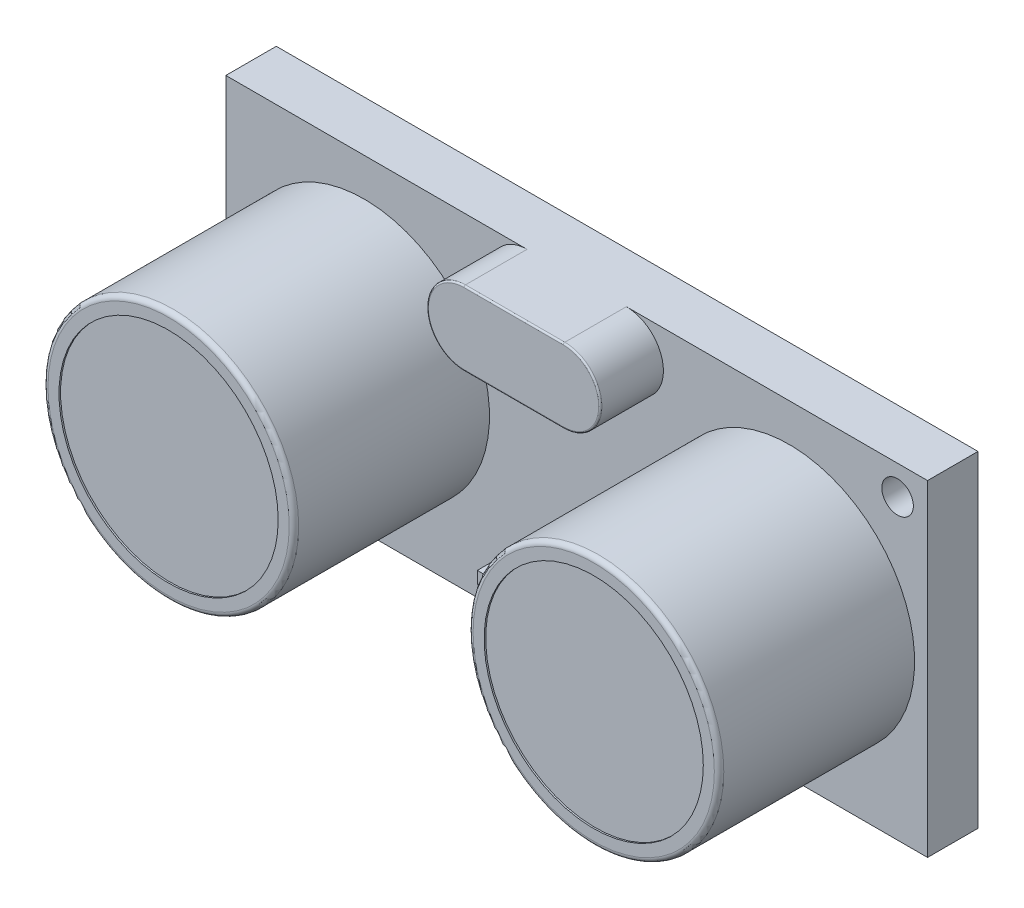
ISO-10303-21;
HEADER;
FILE_DESCRIPTION(('STEP AP214'),'2;1');
FILE_NAME('part.step','',(''),(''),'','','');
FILE_SCHEMA(('AUTOMOTIVE_DESIGN { 1 0 10303 214 1 1 1 1 }'));
ENDSEC;
DATA;
#1=APPLICATION_CONTEXT('core data for automotive mechanical design processes');
#2=APPLICATION_PROTOCOL_DEFINITION('international standard','automotive_design',2000,#1);
#3=PRODUCT_CONTEXT('',#1,'mechanical');
#4=PRODUCT('Part','Part','',(#3));
#5=PRODUCT_RELATED_PRODUCT_CATEGORY('part','',(#4));
#6=PRODUCT_DEFINITION_FORMATION('','',#4);
#7=PRODUCT_DEFINITION_CONTEXT('part definition',#1,'design');
#8=PRODUCT_DEFINITION('design','',#6,#7);
#9=PRODUCT_DEFINITION_SHAPE('','',#8);
#10=(LENGTH_UNIT() NAMED_UNIT(*) SI_UNIT(.MILLI.,.METRE.));
#11=(NAMED_UNIT(*) PLANE_ANGLE_UNIT() SI_UNIT($,.RADIAN.));
#12=(NAMED_UNIT(*) SI_UNIT($,.STERADIAN.) SOLID_ANGLE_UNIT());
#13=UNCERTAINTY_MEASURE_WITH_UNIT(LENGTH_MEASURE(1.E-05),#10,'distance_accuracy_value','');
#14=(GEOMETRIC_REPRESENTATION_CONTEXT(3) GLOBAL_UNCERTAINTY_ASSIGNED_CONTEXT((#13)) GLOBAL_UNIT_ASSIGNED_CONTEXT((#10,
#11,#12)) REPRESENTATION_CONTEXT('',''));
#15=CARTESIAN_POINT('',(0.,0.,0.));
#16=DIRECTION('',(0.,0.,1.));
#17=DIRECTION('',(1.,0.,0.));
#18=AXIS2_PLACEMENT_3D('',#15,#16,#17);
#19=CARTESIAN_POINT('',(-5.15,-7.85,-4.5));
#20=DIRECTION('',(1.,0.,0.));
#21=DIRECTION('',(0.,1.,0.));
#22=AXIS2_PLACEMENT_3D('',#19,#20,#21);
#23=PLANE('',#22);
#24=DIRECTION('',(0.,1.,0.));
#25=VECTOR('',#24,1.);
#26=CARTESIAN_POINT('',(-5.15,-7.85,0.));
#27=LINE('',#26,#25);
#28=CARTESIAN_POINT('',(-5.15,-10.35,0.));
#29=VERTEX_POINT('',#28);
#30=CARTESIAN_POINT('',(-5.15,-7.85,0.));
#31=VERTEX_POINT('',#30);
#32=EDGE_CURVE('E113',#29,#31,#27,.T.);
#33=ORIENTED_EDGE('',*,*,#32,.T.);
#34=DIRECTION('',(0.,0.,1.));
#35=VECTOR('',#34,1.);
#36=CARTESIAN_POINT('',(-5.15,-7.85,-4.5));
#37=LINE('',#36,#35);
#38=CARTESIAN_POINT('',(-5.15,-7.85,-4.5));
#39=VERTEX_POINT('',#38);
#40=EDGE_CURVE('E104',#39,#31,#37,.T.);
#41=ORIENTED_EDGE('',*,*,#40,.F.);
#42=DIRECTION('',(0.,1.,0.));
#43=VECTOR('',#42,1.);
#44=CARTESIAN_POINT('',(-5.15,-7.85,-4.5));
#45=LINE('',#44,#43);
#46=CARTESIAN_POINT('',(-5.15,-10.35,-4.5));
#47=VERTEX_POINT('',#46);
#48=EDGE_CURVE('E98',#47,#39,#45,.T.);
#49=ORIENTED_EDGE('',*,*,#48,.F.);
#50=DIRECTION('',(0.,0.,1.));
#51=VECTOR('',#50,1.);
#52=CARTESIAN_POINT('',(-5.15,-10.35,-4.5));
#53=LINE('',#52,#51);
#54=EDGE_CURVE('E109',#47,#29,#53,.T.);
#55=ORIENTED_EDGE('',*,*,#54,.T.);
#56=EDGE_LOOP('',(#33,#41,#49,#55));
#57=FACE_BOUND('',#56,.T.);
#58=ADVANCED_FACE('F46',(#57),#23,.F.);
#59=CARTESIAN_POINT('',(5.15,-7.85,-4.5));
#60=DIRECTION('',(0.,-1.,0.));
#61=DIRECTION('',(0.,0.,-1.));
#62=AXIS2_PLACEMENT_3D('',#59,#60,#61);
#63=PLANE('',#62);
#64=DIRECTION('',(1.,0.,0.));
#65=VECTOR('',#64,1.);
#66=CARTESIAN_POINT('',(5.15,-7.85,0.));
#67=LINE('',#66,#65);
#68=CARTESIAN_POINT('',(5.15,-7.85,0.));
#69=VERTEX_POINT('',#68);
#70=EDGE_CURVE('E103',#31,#69,#67,.T.);
#71=ORIENTED_EDGE('',*,*,#70,.T.);
#72=DIRECTION('',(0.,0.,1.));
#73=VECTOR('',#72,1.);
#74=CARTESIAN_POINT('',(5.15,-7.85,-4.5));
#75=LINE('',#74,#73);
#76=CARTESIAN_POINT('',(5.15,-7.85,-4.5));
#77=VERTEX_POINT('',#76);
#78=EDGE_CURVE('E101',#77,#69,#75,.T.);
#79=ORIENTED_EDGE('',*,*,#78,.F.);
#80=DIRECTION('',(1.,0.,0.));
#81=VECTOR('',#80,1.);
#82=CARTESIAN_POINT('',(5.15,-7.85,-4.5));
#83=LINE('',#82,#81);
#84=EDGE_CURVE('E93',#39,#77,#83,.T.);
#85=ORIENTED_EDGE('',*,*,#84,.F.);
#86=ORIENTED_EDGE('',*,*,#40,.T.);
#87=EDGE_LOOP('',(#71,#79,#85,#86));
#88=FACE_BOUND('',#87,.T.);
#89=ADVANCED_FACE('F102',(#88),#63,.F.);
#90=CARTESIAN_POINT('',(5.15,-7.85,-4.5));
#91=DIRECTION('',(-1.,0.,0.));
#92=DIRECTION('',(0.,0.,1.));
#93=AXIS2_PLACEMENT_3D('',#90,#91,#92);
#94=PLANE('',#93);
#95=DIRECTION('',(0.,-1.,0.));
#96=VECTOR('',#95,1.);
#97=CARTESIAN_POINT('',(5.15,-7.85,0.));
#98=LINE('',#97,#96);
#99=CARTESIAN_POINT('',(5.15,-10.35,0.));
#100=VERTEX_POINT('',#99);
#101=EDGE_CURVE('E79',#69,#100,#98,.T.);
#102=ORIENTED_EDGE('',*,*,#101,.T.);
#103=DIRECTION('',(0.,0.,1.));
#104=VECTOR('',#103,1.);
#105=CARTESIAN_POINT('',(5.15,-10.35,-4.5));
#106=LINE('',#105,#104);
#107=CARTESIAN_POINT('',(5.15,-10.35,-4.5));
#108=VERTEX_POINT('',#107);
#109=EDGE_CURVE('E105',#108,#100,#106,.T.);
#110=ORIENTED_EDGE('',*,*,#109,.F.);
#111=DIRECTION('',(0.,-1.,0.));
#112=VECTOR('',#111,1.);
#113=CARTESIAN_POINT('',(5.15,-7.85,-4.5));
#114=LINE('',#113,#112);
#115=EDGE_CURVE('E96',#77,#108,#114,.T.);
#116=ORIENTED_EDGE('',*,*,#115,.F.);
#117=ORIENTED_EDGE('',*,*,#78,.T.);
#118=EDGE_LOOP('',(#102,#110,#116,#117));
#119=FACE_BOUND('',#118,.T.);
#120=ADVANCED_FACE('F107',(#119),#94,.F.);
#121=CARTESIAN_POINT('',(5.15,-10.35,-4.5));
#122=DIRECTION('',(0.,1.,0.));
#123=DIRECTION('',(0.,0.,1.));
#124=AXIS2_PLACEMENT_3D('',#121,#122,#123);
#125=PLANE('',#124);
#126=CARTESIAN_POINT('',(3.60521937867282,-10.35,-3.53307553741537));
#127=DIRECTION('',(0.,1.,0.));
#128=DIRECTION('',(0.,0.,1.));
#129=AXIS2_PLACEMENT_3D('',#126,#127,#128);
#130=CIRCLE('',#129,0.600934077009731);
#131=CARTESIAN_POINT('',(3.60521937867282,-10.35,-2.93214146040564));
#132=VERTEX_POINT('',#131);
#133=EDGE_CURVE('E12',#132,#132,#130,.F.);
#134=ORIENTED_EDGE('',*,*,#133,.F.);
#135=EDGE_LOOP('',(#134));
#136=FACE_BOUND('',#135,.T.);
#137=CARTESIAN_POINT('',(1.10521937867282,-10.35,-3.53307553741537));
#138=DIRECTION('',(0.,1.,0.));
#139=DIRECTION('',(0.,0.,1.));
#140=AXIS2_PLACEMENT_3D('',#137,#138,#139);
#141=CIRCLE('',#140,0.600934077009731);
#142=CARTESIAN_POINT('',(1.10521937867282,-10.35,-2.93214146040564));
#143=VERTEX_POINT('',#142);
#144=EDGE_CURVE('E54',#143,#143,#141,.F.);
#145=ORIENTED_EDGE('',*,*,#144,.F.);
#146=EDGE_LOOP('',(#145));
#147=FACE_BOUND('',#146,.T.);
#148=CARTESIAN_POINT('',(-1.39478062132718,-10.35,-3.53307553741537));
#149=DIRECTION('',(0.,1.,0.));
#150=DIRECTION('',(0.,0.,1.));
#151=AXIS2_PLACEMENT_3D('',#148,#149,#150);
#152=CIRCLE('',#151,0.600934077009731);
#153=CARTESIAN_POINT('',(-1.39478062132718,-10.35,-2.93214146040564));
#154=VERTEX_POINT('',#153);
#155=EDGE_CURVE('E126',#154,#154,#152,.F.);
#156=ORIENTED_EDGE('',*,*,#155,.F.);
#157=EDGE_LOOP('',(#156));
#158=FACE_BOUND('',#157,.T.);
#159=CARTESIAN_POINT('',(-3.89478062132718,-10.35,-3.53307553741537));
#160=DIRECTION('',(0.,1.,0.));
#161=DIRECTION('',(0.,0.,1.));
#162=AXIS2_PLACEMENT_3D('',#159,#160,#161);
#163=CIRCLE('',#162,0.600934077009731);
#164=CARTESIAN_POINT('',(-3.89478062132718,-10.35,-2.93214146040564));
#165=VERTEX_POINT('',#164);
#166=EDGE_CURVE('E123',#165,#165,#163,.F.);
#167=ORIENTED_EDGE('',*,*,#166,.F.);
#168=EDGE_LOOP('',(#167));
#169=FACE_BOUND('',#168,.T.);
#170=DIRECTION('',(-1.,0.,0.));
#171=VECTOR('',#170,1.);
#172=CARTESIAN_POINT('',(5.15,-10.35,0.));
#173=LINE('',#172,#171);
#174=EDGE_CURVE('E85',#100,#29,#173,.T.);
#175=ORIENTED_EDGE('',*,*,#174,.T.);
#176=ORIENTED_EDGE('',*,*,#54,.F.);
#177=DIRECTION('',(-1.,0.,0.));
#178=VECTOR('',#177,1.);
#179=CARTESIAN_POINT('',(5.15,-10.35,-4.5));
#180=LINE('',#179,#178);
#181=EDGE_CURVE('E62',#108,#47,#180,.T.);
#182=ORIENTED_EDGE('',*,*,#181,.F.);
#183=ORIENTED_EDGE('',*,*,#109,.T.);
#184=EDGE_LOOP('',(#175,#176,#182,#183));
#185=FACE_BOUND('',#184,.T.);
#186=ADVANCED_FACE('F133',(#136,#147,#158,#169,#185),#125,.F.);
#187=CARTESIAN_POINT('',(0.,0.,-4.5));
#188=DIRECTION('',(0.,0.,-1.));
#189=DIRECTION('',(-1.,0.,0.));
#190=AXIS2_PLACEMENT_3D('',#187,#188,#189);
#191=PLANE('',#190);
#192=ORIENTED_EDGE('',*,*,#48,.T.);
#193=ORIENTED_EDGE('',*,*,#84,.T.);
#194=ORIENTED_EDGE('',*,*,#115,.T.);
#195=ORIENTED_EDGE('',*,*,#181,.T.);
#196=EDGE_LOOP('',(#192,#193,#194,#195));
#197=FACE_BOUND('',#196,.T.);
#198=ADVANCED_FACE('F94',(#197),#191,.T.);
#199=CARTESIAN_POINT('',(0.,0.,0.));
#200=DIRECTION('',(0.,0.,-1.));
#201=DIRECTION('',(-1.,0.,0.));
#202=AXIS2_PLACEMENT_3D('',#199,#200,#201);
#203=PLANE('',#202);
#204=ORIENTED_EDGE('',*,*,#32,.F.);
#205=ORIENTED_EDGE('',*,*,#174,.F.);
#206=ORIENTED_EDGE('',*,*,#101,.F.);
#207=ORIENTED_EDGE('',*,*,#70,.F.);
#208=EDGE_LOOP('',(#204,#205,#206,#207));
#209=FACE_BOUND('',#208,.T.);
#210=ADVANCED_FACE('F145',(#209),#203,.F.);
#211=CARTESIAN_POINT('',(-3.89478062132718,-18.35,-3.53307553741537));
#212=DIRECTION('',(0.,1.,0.));
#213=DIRECTION('',(0.,0.,1.));
#214=AXIS2_PLACEMENT_3D('',#211,#212,#213);
#215=CYLINDRICAL_SURFACE('',#214,0.600934077009731);
#216=CARTESIAN_POINT('',(-3.89478062132718,-18.35,-3.53307553741537));
#217=DIRECTION('',(0.,-1.,0.));
#218=DIRECTION('',(0.,0.,-1.));
#219=AXIS2_PLACEMENT_3D('',#216,#217,#218);
#220=CIRCLE('',#219,0.600934077009731);
#221=CARTESIAN_POINT('',(-3.89478062132718,-18.35,-4.1340096144251));
#222=VERTEX_POINT('',#221);
#223=EDGE_CURVE('E116',#222,#222,#220,.T.);
#224=ORIENTED_EDGE('',*,*,#223,.F.);
#225=EDGE_LOOP('',(#224));
#226=FACE_BOUND('',#225,.T.);
#227=ORIENTED_EDGE('',*,*,#166,.T.);
#228=EDGE_LOOP('',(#227));
#229=FACE_BOUND('',#228,.T.);
#230=ADVANCED_FACE('F142',(#226,#229),#215,.T.);
#231=CARTESIAN_POINT('',(-3.89478062132718,-18.35,-3.53307553741537));
#232=DIRECTION('',(0.,-1.,0.));
#233=DIRECTION('',(0.,0.,-1.));
#234=AXIS2_PLACEMENT_3D('',#231,#232,#233);
#235=PLANE('',#234);
#236=ORIENTED_EDGE('',*,*,#223,.T.);
#237=EDGE_LOOP('',(#236));
#238=FACE_BOUND('',#237,.T.);
#239=ADVANCED_FACE('F144',(#238),#235,.T.);
#240=CARTESIAN_POINT('',(-1.39478062132718,-18.35,-3.53307553741537));
#241=DIRECTION('',(0.,1.,0.));
#242=DIRECTION('',(0.,0.,1.));
#243=AXIS2_PLACEMENT_3D('',#240,#241,#242);
#244=CYLINDRICAL_SURFACE('',#243,0.600934077009731);
#245=CARTESIAN_POINT('',(-1.39478062132718,-18.35,-3.53307553741537));
#246=DIRECTION('',(0.,-1.,0.));
#247=DIRECTION('',(0.,0.,-1.));
#248=AXIS2_PLACEMENT_3D('',#245,#246,#247);
#249=CIRCLE('',#248,0.600934077009731);
#250=CARTESIAN_POINT('',(-1.39478062132718,-18.35,-4.1340096144251));
#251=VERTEX_POINT('',#250);
#252=EDGE_CURVE('E168',#251,#251,#249,.T.);
#253=ORIENTED_EDGE('',*,*,#252,.F.);
#254=EDGE_LOOP('',(#253));
#255=FACE_BOUND('',#254,.T.);
#256=ORIENTED_EDGE('',*,*,#155,.T.);
#257=EDGE_LOOP('',(#256));
#258=FACE_BOUND('',#257,.T.);
#259=ADVANCED_FACE('F152',(#255,#258),#244,.T.);
#260=CARTESIAN_POINT('',(-1.39478062132718,-18.35,-3.53307553741537));
#261=DIRECTION('',(0.,-1.,0.));
#262=DIRECTION('',(0.,0.,-1.));
#263=AXIS2_PLACEMENT_3D('',#260,#261,#262);
#264=PLANE('',#263);
#265=ORIENTED_EDGE('',*,*,#252,.T.);
#266=EDGE_LOOP('',(#265));
#267=FACE_BOUND('',#266,.T.);
#268=ADVANCED_FACE('F196',(#267),#264,.T.);
#269=CARTESIAN_POINT('',(1.10521937867282,-18.35,-3.53307553741537));
#270=DIRECTION('',(0.,1.,0.));
#271=DIRECTION('',(0.,0.,1.));
#272=AXIS2_PLACEMENT_3D('',#269,#270,#271);
#273=CYLINDRICAL_SURFACE('',#272,0.600934077009731);
#274=CARTESIAN_POINT('',(1.10521937867282,-18.35,-3.53307553741537));
#275=DIRECTION('',(0.,-1.,0.));
#276=DIRECTION('',(0.,0.,-1.));
#277=AXIS2_PLACEMENT_3D('',#274,#275,#276);
#278=CIRCLE('',#277,0.600934077009731);
#279=CARTESIAN_POINT('',(1.10521937867282,-18.35,-4.1340096144251));
#280=VERTEX_POINT('',#279);
#281=EDGE_CURVE('E171',#280,#280,#278,.T.);
#282=ORIENTED_EDGE('',*,*,#281,.F.);
#283=EDGE_LOOP('',(#282));
#284=FACE_BOUND('',#283,.T.);
#285=ORIENTED_EDGE('',*,*,#144,.T.);
#286=EDGE_LOOP('',(#285));
#287=FACE_BOUND('',#286,.T.);
#288=ADVANCED_FACE('F131',(#284,#287),#273,.T.);
#289=CARTESIAN_POINT('',(1.10521937867282,-18.35,-3.53307553741537));
#290=DIRECTION('',(0.,-1.,0.));
#291=DIRECTION('',(0.,0.,-1.));
#292=AXIS2_PLACEMENT_3D('',#289,#290,#291);
#293=PLANE('',#292);
#294=ORIENTED_EDGE('',*,*,#281,.T.);
#295=EDGE_LOOP('',(#294));
#296=FACE_BOUND('',#295,.T.);
#297=ADVANCED_FACE('F183',(#296),#293,.T.);
#298=CARTESIAN_POINT('',(3.60521937867282,-18.35,-3.53307553741537));
#299=DIRECTION('',(0.,1.,0.));
#300=DIRECTION('',(0.,0.,1.));
#301=AXIS2_PLACEMENT_3D('',#298,#299,#300);
#302=CYLINDRICAL_SURFACE('',#301,0.600934077009731);
#303=CARTESIAN_POINT('',(3.60521937867282,-18.35,-3.53307553741537));
#304=DIRECTION('',(0.,-1.,0.));
#305=DIRECTION('',(0.,0.,-1.));
#306=AXIS2_PLACEMENT_3D('',#303,#304,#305);
#307=CIRCLE('',#306,0.600934077009731);
#308=CARTESIAN_POINT('',(3.60521937867282,-18.35,-4.1340096144251));
#309=VERTEX_POINT('',#308);
#310=EDGE_CURVE('E174',#309,#309,#307,.T.);
#311=ORIENTED_EDGE('',*,*,#310,.F.);
#312=EDGE_LOOP('',(#311));
#313=FACE_BOUND('',#312,.T.);
#314=ORIENTED_EDGE('',*,*,#133,.T.);
#315=EDGE_LOOP('',(#314));
#316=FACE_BOUND('',#315,.T.);
#317=ADVANCED_FACE('F180',(#313,#316),#302,.T.);
#318=CARTESIAN_POINT('',(3.60521937867282,-18.35,-3.53307553741537));
#319=DIRECTION('',(0.,-1.,0.));
#320=DIRECTION('',(0.,0.,-1.));
#321=AXIS2_PLACEMENT_3D('',#318,#319,#320);
#322=PLANE('',#321);
#323=ORIENTED_EDGE('',*,*,#310,.T.);
#324=EDGE_LOOP('',(#323));
#325=FACE_BOUND('',#324,.T.);
#326=ADVANCED_FACE('F178',(#325),#322,.T.);
#327=CLOSED_SHELL('',(#58,#89,#120,#186,#198,#210,#230,#239,#259,#268,#288,#297,#317,#326));
#328=MANIFOLD_SOLID_BREP('B2',#327);
#329=CARTESIAN_POINT('',(0.,0.,3.2));
#330=DIRECTION('',(0.,0.,-1.));
#331=DIRECTION('',(-1.,0.,0.));
#332=AXIS2_PLACEMENT_3D('',#329,#330,#331);
#333=PLANE('',#332);
#334=CARTESIAN_POINT('',(-20.35,-8.5,3.2));
#335=DIRECTION('',(0.,0.,-1.));
#336=DIRECTION('',(-1.,0.,0.));
#337=AXIS2_PLACEMENT_3D('',#334,#335,#336);
#338=CIRCLE('',#337,1.);
#339=CARTESIAN_POINT('',(-21.35,-8.5,3.2));
#340=VERTEX_POINT('',#339);
#341=EDGE_CURVE('E647',#340,#340,#338,.T.);
#342=ORIENTED_EDGE('',*,*,#341,.T.);
#343=EDGE_LOOP('',(#342));
#344=FACE_BOUND('',#343,.T.);
#345=CARTESIAN_POINT('',(20.35,8.5,3.2));
#346=DIRECTION('',(0.,0.,-1.));
#347=DIRECTION('',(-1.,0.,0.));
#348=AXIS2_PLACEMENT_3D('',#345,#346,#347);
#349=CIRCLE('',#348,1.);
#350=CARTESIAN_POINT('',(19.35,8.5,3.2));
#351=VERTEX_POINT('',#350);
#352=EDGE_CURVE('E628',#351,#351,#349,.T.);
#353=ORIENTED_EDGE('',*,*,#352,.T.);
#354=EDGE_LOOP('',(#353));
#355=FACE_BOUND('',#354,.T.);
#356=CARTESIAN_POINT('',(-3.15,8.,3.2));
#357=DIRECTION('',(0.,0.,1.));
#358=DIRECTION('',(1.,0.,0.));
#359=AXIS2_PLACEMENT_3D('',#356,#357,#358);
#360=CIRCLE('',#359,2.35);
#361=CARTESIAN_POINT('',(-3.15,10.35,3.2));
#362=VERTEX_POINT('',#361);
#363=CARTESIAN_POINT('',(-3.15,5.65,3.2));
#364=VERTEX_POINT('',#363);
#365=EDGE_CURVE('E429',#362,#364,#360,.T.);
#366=ORIENTED_EDGE('',*,*,#365,.F.);
#367=DIRECTION('',(-1.,0.,0.));
#368=VECTOR('',#367,1.);
#369=CARTESIAN_POINT('',(-22.25,10.35,3.2));
#370=LINE('',#369,#368);
#371=CARTESIAN_POINT('',(-22.25,10.35,3.2));
#372=VERTEX_POINT('',#371);
#373=EDGE_CURVE('E451',#362,#372,#370,.T.);
#374=ORIENTED_EDGE('',*,*,#373,.T.);
#375=DIRECTION('',(0.,-1.,0.));
#376=VECTOR('',#375,1.);
#377=CARTESIAN_POINT('',(-22.25,-10.35,3.2));
#378=LINE('',#377,#376);
#379=CARTESIAN_POINT('',(-22.25,-10.35,3.2));
#380=VERTEX_POINT('',#379);
#381=EDGE_CURVE('E456',#372,#380,#378,.T.);
#382=ORIENTED_EDGE('',*,*,#381,.T.);
#383=DIRECTION('',(1.,0.,0.));
#384=VECTOR('',#383,1.);
#385=CARTESIAN_POINT('',(-22.25,-10.35,3.2));
#386=LINE('',#385,#384);
#387=CARTESIAN_POINT('',(22.25,-10.35,3.2));
#388=VERTEX_POINT('',#387);
#389=EDGE_CURVE('E458',#380,#388,#386,.T.);
#390=ORIENTED_EDGE('',*,*,#389,.T.);
#391=DIRECTION('',(0.,1.,0.));
#392=VECTOR('',#391,1.);
#393=CARTESIAN_POINT('',(22.25,-10.35,3.2));
#394=LINE('',#393,#392);
#395=CARTESIAN_POINT('',(22.25,10.35,3.2));
#396=VERTEX_POINT('',#395);
#397=EDGE_CURVE('E448',#388,#396,#394,.T.);
#398=ORIENTED_EDGE('',*,*,#397,.T.);
#399=CARTESIAN_POINT('',(3.15,10.35,3.2));
#400=VERTEX_POINT('',#399);
#401=EDGE_CURVE('E453',#396,#400,#370,.T.);
#402=ORIENTED_EDGE('',*,*,#401,.T.);
#403=CARTESIAN_POINT('',(3.15,8.,3.2));
#404=DIRECTION('',(0.,0.,1.));
#405=DIRECTION('',(1.,0.,0.));
#406=AXIS2_PLACEMENT_3D('',#403,#404,#405);
#407=CIRCLE('',#406,2.35);
#408=CARTESIAN_POINT('',(3.15,5.65,3.2));
#409=VERTEX_POINT('',#408);
#410=EDGE_CURVE('E436',#409,#400,#407,.T.);
#411=ORIENTED_EDGE('',*,*,#410,.F.);
#412=DIRECTION('',(1.,0.,0.));
#413=VECTOR('',#412,1.);
#414=CARTESIAN_POINT('',(-3.15,5.65,3.2));
#415=LINE('',#414,#413);
#416=EDGE_CURVE('E432',#364,#409,#415,.T.);
#417=ORIENTED_EDGE('',*,*,#416,.F.);
#418=EDGE_LOOP('',(#366,#374,#382,#390,#398,#402,#411,#417));
#419=FACE_BOUND('',#418,.T.);
#420=CARTESIAN_POINT('',(-13.48,0.,3.2));
#421=DIRECTION('',(0.,0.,-1.));
#422=DIRECTION('',(-1.,0.,0.));
#423=AXIS2_PLACEMENT_3D('',#420,#421,#422);
#424=CIRCLE('',#423,7.95);
#425=CARTESIAN_POINT('',(-21.43,0.,3.2));
#426=VERTEX_POINT('',#425);
#427=EDGE_CURVE('E497',#426,#426,#424,.F.);
#428=ORIENTED_EDGE('',*,*,#427,.F.);
#429=EDGE_LOOP('',(#428));
#430=FACE_BOUND('',#429,.T.);
#431=CARTESIAN_POINT('',(13.48,0.,3.2));
#432=DIRECTION('',(0.,0.,-1.));
#433=DIRECTION('',(-1.,0.,0.));
#434=AXIS2_PLACEMENT_3D('',#431,#432,#433);
#435=CIRCLE('',#434,7.95);
#436=CARTESIAN_POINT('',(5.53,0.,3.2));
#437=VERTEX_POINT('',#436);
#438=EDGE_CURVE('E508',#437,#437,#435,.F.);
#439=ORIENTED_EDGE('',*,*,#438,.F.);
#440=EDGE_LOOP('',(#439));
#441=FACE_BOUND('',#440,.T.);
#442=DIRECTION('',(0.,1.,0.));
#443=VECTOR('',#442,1.);
#444=CARTESIAN_POINT('',(5.30253265313219,-7.85994884424464,3.2));
#445=LINE('',#444,#443);
#446=CARTESIAN_POINT('',(5.30253265313219,-8.61074992787398,3.2));
#447=VERTEX_POINT('',#446);
#448=CARTESIAN_POINT('',(5.30253265313219,-7.85994884424464,3.2));
#449=VERTEX_POINT('',#448);
#450=EDGE_CURVE('E410',#447,#449,#445,.T.);
#451=ORIENTED_EDGE('',*,*,#450,.F.);
#452=DIRECTION('',(1.,0.,0.));
#453=VECTOR('',#452,1.);
#454=CARTESIAN_POINT('',(-5.30253265313219,-8.61074992787398,3.2));
#455=LINE('',#454,#453);
#456=CARTESIAN_POINT('',(-5.30253265313219,-8.61074992787398,3.2));
#457=VERTEX_POINT('',#456);
#458=EDGE_CURVE('E407',#457,#447,#455,.T.);
#459=ORIENTED_EDGE('',*,*,#458,.F.);
#460=DIRECTION('',(0.,-1.,0.));
#461=VECTOR('',#460,1.);
#462=CARTESIAN_POINT('',(-5.30253265313219,-7.85994884424464,3.2));
#463=LINE('',#462,#461);
#464=CARTESIAN_POINT('',(-5.30253265313219,-7.85994884424464,3.2));
#465=VERTEX_POINT('',#464);
#466=EDGE_CURVE('E309',#465,#457,#463,.T.);
#467=ORIENTED_EDGE('',*,*,#466,.F.);
#468=DIRECTION('',(-1.,0.,0.));
#469=VECTOR('',#468,1.);
#470=CARTESIAN_POINT('',(-5.30253265313219,-7.85994884424464,3.2));
#471=LINE('',#470,#469);
#472=EDGE_CURVE('E304',#449,#465,#471,.T.);
#473=ORIENTED_EDGE('',*,*,#472,.F.);
#474=EDGE_LOOP('',(#451,#459,#467,#473));
#475=FACE_BOUND('',#474,.T.);
#476=ADVANCED_FACE('F289',(#344,#355,#419,#430,#441,#475),#333,.F.);
#477=CARTESIAN_POINT('',(22.25,-10.35,3.2));
#478=DIRECTION('',(-1.,0.,0.));
#479=DIRECTION('',(0.,0.,1.));
#480=AXIS2_PLACEMENT_3D('',#477,#478,#479);
#481=PLANE('',#480);
#482=DIRECTION('',(0.,1.,0.));
#483=VECTOR('',#482,1.);
#484=CARTESIAN_POINT('',(22.25,-10.35,0.));
#485=LINE('',#484,#483);
#486=CARTESIAN_POINT('',(22.25,-10.35,0.));
#487=VERTEX_POINT('',#486);
#488=CARTESIAN_POINT('',(22.25,10.35,0.));
#489=VERTEX_POINT('',#488);
#490=EDGE_CURVE('E447',#487,#489,#485,.T.);
#491=ORIENTED_EDGE('',*,*,#490,.T.);
#492=DIRECTION('',(0.,0.,-1.));
#493=VECTOR('',#492,1.);
#494=CARTESIAN_POINT('',(22.25,10.35,3.2));
#495=LINE('',#494,#493);
#496=EDGE_CURVE('E476',#396,#489,#495,.T.);
#497=ORIENTED_EDGE('',*,*,#496,.F.);
#498=ORIENTED_EDGE('',*,*,#397,.F.);
#499=DIRECTION('',(0.,0.,-1.));
#500=VECTOR('',#499,1.);
#501=CARTESIAN_POINT('',(22.25,-10.35,3.2));
#502=LINE('',#501,#500);
#503=EDGE_CURVE('E460',#388,#487,#502,.T.);
#504=ORIENTED_EDGE('',*,*,#503,.T.);
#505=EDGE_LOOP('',(#491,#497,#498,#504));
#506=FACE_BOUND('',#505,.T.);
#507=ADVANCED_FACE('F534',(#506),#481,.F.);
#508=CARTESIAN_POINT('',(-22.25,10.35,3.2));
#509=DIRECTION('',(0.,-1.,0.));
#510=DIRECTION('',(0.,0.,-1.));
#511=AXIS2_PLACEMENT_3D('',#508,#509,#510);
#512=PLANE('',#511);
#513=DIRECTION('',(0.,0.,-1.));
#514=VECTOR('',#513,1.);
#515=CARTESIAN_POINT('',(-3.15,10.35,7.2));
#516=LINE('',#515,#514);
#517=CARTESIAN_POINT('',(-3.15,10.35,7.1));
#518=VERTEX_POINT('',#517);
#519=EDGE_CURVE('E439',#518,#362,#516,.T.);
#520=ORIENTED_EDGE('',*,*,#519,.F.);
#521=DIRECTION('',(-1.,0.,0.));
#522=VECTOR('',#521,1.);
#523=CARTESIAN_POINT('',(3.15,10.35,7.1));
#524=LINE('',#523,#522);
#525=CARTESIAN_POINT('',(3.15,10.35,7.1));
#526=VERTEX_POINT('',#525);
#527=EDGE_CURVE('E488',#518,#526,#524,.F.);
#528=ORIENTED_EDGE('',*,*,#527,.T.);
#529=DIRECTION('',(0.,0.,-1.));
#530=VECTOR('',#529,1.);
#531=CARTESIAN_POINT('',(3.15,10.35,7.2));
#532=LINE('',#531,#530);
#533=EDGE_CURVE('E441',#526,#400,#532,.T.);
#534=ORIENTED_EDGE('',*,*,#533,.T.);
#535=ORIENTED_EDGE('',*,*,#401,.F.);
#536=ORIENTED_EDGE('',*,*,#496,.T.);
#537=DIRECTION('',(-1.,0.,0.));
#538=VECTOR('',#537,1.);
#539=CARTESIAN_POINT('',(-22.25,10.35,0.));
#540=LINE('',#539,#538);
#541=CARTESIAN_POINT('',(-22.25,10.35,0.));
#542=VERTEX_POINT('',#541);
#543=EDGE_CURVE('E463',#489,#542,#540,.T.);
#544=ORIENTED_EDGE('',*,*,#543,.T.);
#545=DIRECTION('',(0.,0.,-1.));
#546=VECTOR('',#545,1.);
#547=CARTESIAN_POINT('',(-22.25,10.35,3.2));
#548=LINE('',#547,#546);
#549=EDGE_CURVE('E473',#372,#542,#548,.T.);
#550=ORIENTED_EDGE('',*,*,#549,.F.);
#551=ORIENTED_EDGE('',*,*,#373,.F.);
#552=EDGE_LOOP('',(#520,#528,#534,#535,#536,#544,#550,#551));
#553=FACE_BOUND('',#552,.T.);
#554=ADVANCED_FACE('F540',(#553),#512,.F.);
#555=CARTESIAN_POINT('',(-22.25,-10.35,3.2));
#556=DIRECTION('',(1.,0.,0.));
#557=DIRECTION('',(0.,0.,-1.));
#558=AXIS2_PLACEMENT_3D('',#555,#556,#557);
#559=PLANE('',#558);
#560=DIRECTION('',(0.,-1.,0.));
#561=VECTOR('',#560,1.);
#562=CARTESIAN_POINT('',(-22.25,-10.35,0.));
#563=LINE('',#562,#561);
#564=CARTESIAN_POINT('',(-22.25,-10.35,0.));
#565=VERTEX_POINT('',#564);
#566=EDGE_CURVE('E465',#542,#565,#563,.T.);
#567=ORIENTED_EDGE('',*,*,#566,.T.);
#568=DIRECTION('',(0.,0.,-1.));
#569=VECTOR('',#568,1.);
#570=CARTESIAN_POINT('',(-22.25,-10.35,3.2));
#571=LINE('',#570,#569);
#572=EDGE_CURVE('E470',#380,#565,#571,.T.);
#573=ORIENTED_EDGE('',*,*,#572,.F.);
#574=ORIENTED_EDGE('',*,*,#381,.F.);
#575=ORIENTED_EDGE('',*,*,#549,.T.);
#576=EDGE_LOOP('',(#567,#573,#574,#575));
#577=FACE_BOUND('',#576,.T.);
#578=ADVANCED_FACE('F556',(#577),#559,.F.);
#579=CARTESIAN_POINT('',(-22.25,-10.35,3.2));
#580=DIRECTION('',(0.,1.,0.));
#581=DIRECTION('',(0.,0.,1.));
#582=AXIS2_PLACEMENT_3D('',#579,#580,#581);
#583=PLANE('',#582);
#584=DIRECTION('',(1.,0.,0.));
#585=VECTOR('',#584,1.);
#586=CARTESIAN_POINT('',(-22.25,-10.35,0.));
#587=LINE('',#586,#585);
#588=EDGE_CURVE('E452',#565,#487,#587,.T.);
#589=ORIENTED_EDGE('',*,*,#588,.T.);
#590=ORIENTED_EDGE('',*,*,#503,.F.);
#591=ORIENTED_EDGE('',*,*,#389,.F.);
#592=ORIENTED_EDGE('',*,*,#572,.T.);
#593=EDGE_LOOP('',(#589,#590,#591,#592));
#594=FACE_BOUND('',#593,.T.);
#595=ADVANCED_FACE('F552',(#594),#583,.F.);
#596=CARTESIAN_POINT('',(0.,0.,0.));
#597=DIRECTION('',(0.,0.,-1.));
#598=DIRECTION('',(-1.,0.,0.));
#599=AXIS2_PLACEMENT_3D('',#596,#597,#598);
#600=PLANE('',#599);
#601=CARTESIAN_POINT('',(-20.35,-8.5,0.));
#602=DIRECTION('',(0.,0.,-1.));
#603=DIRECTION('',(-1.,0.,0.));
#604=AXIS2_PLACEMENT_3D('',#601,#602,#603);
#605=CIRCLE('',#604,1.);
#606=CARTESIAN_POINT('',(-21.35,-8.5,0.));
#607=VERTEX_POINT('',#606);
#608=EDGE_CURVE('E649',#607,#607,#605,.T.);
#609=ORIENTED_EDGE('',*,*,#608,.F.);
#610=EDGE_LOOP('',(#609));
#611=FACE_BOUND('',#610,.T.);
#612=CARTESIAN_POINT('',(20.35,8.5,0.));
#613=DIRECTION('',(0.,0.,-1.));
#614=DIRECTION('',(-1.,0.,0.));
#615=AXIS2_PLACEMENT_3D('',#612,#613,#614);
#616=CIRCLE('',#615,1.);
#617=CARTESIAN_POINT('',(19.35,8.5,0.));
#618=VERTEX_POINT('',#617);
#619=EDGE_CURVE('E644',#618,#618,#616,.T.);
#620=ORIENTED_EDGE('',*,*,#619,.F.);
#621=EDGE_LOOP('',(#620));
#622=FACE_BOUND('',#621,.T.);
#623=ORIENTED_EDGE('',*,*,#490,.F.);
#624=ORIENTED_EDGE('',*,*,#588,.F.);
#625=ORIENTED_EDGE('',*,*,#566,.F.);
#626=ORIENTED_EDGE('',*,*,#543,.F.);
#627=EDGE_LOOP('',(#623,#624,#625,#626));
#628=FACE_BOUND('',#627,.T.);
#629=ADVANCED_FACE('F549',(#611,#622,#628),#600,.T.);
#630=CARTESIAN_POINT('',(-3.15,8.,7.2));
#631=DIRECTION('',(0.,0.,-1.));
#632=DIRECTION('',(-1.,0.,0.));
#633=AXIS2_PLACEMENT_3D('',#630,#631,#632);
#634=CYLINDRICAL_SURFACE('',#633,2.35);
#635=DIRECTION('',(0.,0.,-1.));
#636=VECTOR('',#635,1.);
#637=CARTESIAN_POINT('',(-3.15,5.65,7.2));
#638=LINE('',#637,#636);
#639=CARTESIAN_POINT('',(-3.15,5.65,7.1));
#640=VERTEX_POINT('',#639);
#641=EDGE_CURVE('E445',#640,#364,#638,.T.);
#642=ORIENTED_EDGE('',*,*,#641,.F.);
#643=CARTESIAN_POINT('',(-3.15,8.,7.1));
#644=DIRECTION('',(0.,0.,1.));
#645=DIRECTION('',(1.,0.,0.));
#646=AXIS2_PLACEMENT_3D('',#643,#644,#645);
#647=CIRCLE('',#646,2.35);
#648=EDGE_CURVE('E495',#640,#518,#647,.F.);
#649=ORIENTED_EDGE('',*,*,#648,.T.);
#650=ORIENTED_EDGE('',*,*,#519,.T.);
#651=ORIENTED_EDGE('',*,*,#365,.T.);
#652=EDGE_LOOP('',(#642,#649,#650,#651));
#653=FACE_BOUND('',#652,.T.);
#654=ADVANCED_FACE('F547',(#653),#634,.T.);
#655=CARTESIAN_POINT('',(-3.15,5.65,7.2));
#656=DIRECTION('',(0.,1.,0.));
#657=DIRECTION('',(0.,0.,1.));
#658=AXIS2_PLACEMENT_3D('',#655,#656,#657);
#659=PLANE('',#658);
#660=DIRECTION('',(0.,0.,-1.));
#661=VECTOR('',#660,1.);
#662=CARTESIAN_POINT('',(3.15,5.65,7.2));
#663=LINE('',#662,#661);
#664=CARTESIAN_POINT('',(3.15,5.65,7.1));
#665=VERTEX_POINT('',#664);
#666=EDGE_CURVE('E443',#665,#409,#663,.T.);
#667=ORIENTED_EDGE('',*,*,#666,.F.);
#668=DIRECTION('',(1.,0.,0.));
#669=VECTOR('',#668,1.);
#670=CARTESIAN_POINT('',(-3.15,5.65,7.1));
#671=LINE('',#670,#669);
#672=EDGE_CURVE('E493',#665,#640,#671,.F.);
#673=ORIENTED_EDGE('',*,*,#672,.T.);
#674=ORIENTED_EDGE('',*,*,#641,.T.);
#675=ORIENTED_EDGE('',*,*,#416,.T.);
#676=EDGE_LOOP('',(#667,#673,#674,#675));
#677=FACE_BOUND('',#676,.T.);
#678=ADVANCED_FACE('F610',(#677),#659,.F.);
#679=CARTESIAN_POINT('',(3.15,8.,7.2));
#680=DIRECTION('',(0.,0.,-1.));
#681=DIRECTION('',(-1.,0.,0.));
#682=AXIS2_PLACEMENT_3D('',#679,#680,#681);
#683=CYLINDRICAL_SURFACE('',#682,2.35);
#684=ORIENTED_EDGE('',*,*,#533,.F.);
#685=CARTESIAN_POINT('',(3.15,8.,7.1));
#686=DIRECTION('',(0.,0.,1.));
#687=DIRECTION('',(1.,0.,0.));
#688=AXIS2_PLACEMENT_3D('',#685,#686,#687);
#689=CIRCLE('',#688,2.35);
#690=EDGE_CURVE('E491',#526,#665,#689,.F.);
#691=ORIENTED_EDGE('',*,*,#690,.T.);
#692=ORIENTED_EDGE('',*,*,#666,.T.);
#693=ORIENTED_EDGE('',*,*,#410,.T.);
#694=EDGE_LOOP('',(#684,#691,#692,#693));
#695=FACE_BOUND('',#694,.T.);
#696=ADVANCED_FACE('F584',(#695),#683,.T.);
#697=CARTESIAN_POINT('',(-3.15,8.,7.2));
#698=DIRECTION('',(0.,0.,1.));
#699=DIRECTION('',(1.,0.,0.));
#700=AXIS2_PLACEMENT_3D('',#697,#698,#699);
#701=PLANE('',#700);
#702=CARTESIAN_POINT('',(3.15,8.,7.2));
#703=DIRECTION('',(0.,0.,1.));
#704=DIRECTION('',(1.,0.,0.));
#705=AXIS2_PLACEMENT_3D('',#702,#703,#704);
#706=CIRCLE('',#705,2.25);
#707=CARTESIAN_POINT('',(3.15,5.75,7.2));
#708=VERTEX_POINT('',#707);
#709=CARTESIAN_POINT('',(3.15,10.25,7.2));
#710=VERTEX_POINT('',#709);
#711=EDGE_CURVE('E483',#708,#710,#706,.T.);
#712=ORIENTED_EDGE('',*,*,#711,.T.);
#713=DIRECTION('',(-1.,0.,0.));
#714=VECTOR('',#713,1.);
#715=CARTESIAN_POINT('',(-3.15,10.25,7.2));
#716=LINE('',#715,#714);
#717=CARTESIAN_POINT('',(-3.15,10.25,7.2));
#718=VERTEX_POINT('',#717);
#719=EDGE_CURVE('E485',#710,#718,#716,.T.);
#720=ORIENTED_EDGE('',*,*,#719,.T.);
#721=CARTESIAN_POINT('',(-3.15,8.,7.2));
#722=DIRECTION('',(0.,0.,1.));
#723=DIRECTION('',(1.,0.,0.));
#724=AXIS2_PLACEMENT_3D('',#721,#722,#723);
#725=CIRCLE('',#724,2.25);
#726=CARTESIAN_POINT('',(-3.15,5.75,7.2));
#727=VERTEX_POINT('',#726);
#728=EDGE_CURVE('E479',#718,#727,#725,.T.);
#729=ORIENTED_EDGE('',*,*,#728,.T.);
#730=DIRECTION('',(1.,0.,0.));
#731=VECTOR('',#730,1.);
#732=CARTESIAN_POINT('',(3.15,5.75,7.2));
#733=LINE('',#732,#731);
#734=EDGE_CURVE('E481',#727,#708,#733,.T.);
#735=ORIENTED_EDGE('',*,*,#734,.T.);
#736=EDGE_LOOP('',(#712,#720,#729,#735));
#737=FACE_BOUND('',#736,.T.);
#738=ADVANCED_FACE('F579',(#737),#701,.T.);
#739=CARTESIAN_POINT('',(-3.15,5.75,7.1));
#740=DIRECTION('',(-1.,0.,0.));
#741=DIRECTION('',(0.,0.,1.));
#742=AXIS2_PLACEMENT_3D('',#739,#740,#741);
#743=CYLINDRICAL_SURFACE('',#742,0.1);
#744=CARTESIAN_POINT('',(-3.15,5.75,7.1));
#745=DIRECTION('',(-1.,0.,0.));
#746=DIRECTION('',(0.,0.,1.));
#747=AXIS2_PLACEMENT_3D('',#744,#745,#746);
#748=CIRCLE('',#747,0.1);
#749=EDGE_CURVE('E501',#640,#727,#748,.T.);
#750=ORIENTED_EDGE('',*,*,#749,.F.);
#751=ORIENTED_EDGE('',*,*,#672,.F.);
#752=CARTESIAN_POINT('',(3.15,5.75,7.1));
#753=DIRECTION('',(1.,0.,0.));
#754=DIRECTION('',(0.,0.,-1.));
#755=AXIS2_PLACEMENT_3D('',#752,#753,#754);
#756=CIRCLE('',#755,0.1);
#757=EDGE_CURVE('E433',#708,#665,#756,.T.);
#758=ORIENTED_EDGE('',*,*,#757,.F.);
#759=ORIENTED_EDGE('',*,*,#734,.F.);
#760=EDGE_LOOP('',(#750,#751,#758,#759));
#761=FACE_BOUND('',#760,.T.);
#762=ADVANCED_FACE('F576',(#761),#743,.T.);
#763=CARTESIAN_POINT('',(3.15,8.,7.1));
#764=DIRECTION('',(0.,0.,1.));
#765=DIRECTION('',(1.,0.,0.));
#766=AXIS2_PLACEMENT_3D('',#763,#764,#765);
#767=TOROIDAL_SURFACE('',#766,2.25,0.1);
#768=ORIENTED_EDGE('',*,*,#757,.T.);
#769=ORIENTED_EDGE('',*,*,#690,.F.);
#770=CARTESIAN_POINT('',(3.15,10.25,7.1));
#771=DIRECTION('',(-1.,0.,0.));
#772=DIRECTION('',(0.,0.,1.));
#773=AXIS2_PLACEMENT_3D('',#770,#771,#772);
#774=CIRCLE('',#773,0.1);
#775=EDGE_CURVE('E499',#710,#526,#774,.T.);
#776=ORIENTED_EDGE('',*,*,#775,.F.);
#777=ORIENTED_EDGE('',*,*,#711,.F.);
#778=EDGE_LOOP('',(#768,#769,#776,#777));
#779=FACE_BOUND('',#778,.T.);
#780=ADVANCED_FACE('F572',(#779),#767,.T.);
#781=CARTESIAN_POINT('',(-3.15,8.,7.1));
#782=DIRECTION('',(0.,0.,1.));
#783=DIRECTION('',(1.,0.,0.));
#784=AXIS2_PLACEMENT_3D('',#781,#782,#783);
#785=TOROIDAL_SURFACE('',#784,2.25,0.1);
#786=ORIENTED_EDGE('',*,*,#749,.T.);
#787=ORIENTED_EDGE('',*,*,#728,.F.);
#788=CARTESIAN_POINT('',(-3.15,10.25,7.1));
#789=DIRECTION('',(1.,0.,0.));
#790=DIRECTION('',(0.,0.,-1.));
#791=AXIS2_PLACEMENT_3D('',#788,#789,#790);
#792=CIRCLE('',#791,0.1);
#793=EDGE_CURVE('E426',#518,#718,#792,.T.);
#794=ORIENTED_EDGE('',*,*,#793,.F.);
#795=ORIENTED_EDGE('',*,*,#648,.F.);
#796=EDGE_LOOP('',(#786,#787,#794,#795));
#797=FACE_BOUND('',#796,.T.);
#798=ADVANCED_FACE('F568',(#797),#785,.T.);
#799=CARTESIAN_POINT('',(-3.15,10.25,7.1));
#800=DIRECTION('',(1.,0.,0.));
#801=DIRECTION('',(0.,0.,-1.));
#802=AXIS2_PLACEMENT_3D('',#799,#800,#801);
#803=CYLINDRICAL_SURFACE('',#802,0.1);
#804=ORIENTED_EDGE('',*,*,#775,.T.);
#805=ORIENTED_EDGE('',*,*,#527,.F.);
#806=ORIENTED_EDGE('',*,*,#793,.T.);
#807=ORIENTED_EDGE('',*,*,#719,.F.);
#808=EDGE_LOOP('',(#804,#805,#806,#807));
#809=FACE_BOUND('',#808,.T.);
#810=ADVANCED_FACE('F564',(#809),#803,.T.);
#811=CARTESIAN_POINT('',(-13.48,0.,15.6));
#812=DIRECTION('',(0.,0.,-1.));
#813=DIRECTION('',(-1.,0.,0.));
#814=AXIS2_PLACEMENT_3D('',#811,#812,#813);
#815=CYLINDRICAL_SURFACE('',#814,7.95);
#816=CARTESIAN_POINT('',(-13.48,0.,15.3));
#817=DIRECTION('',(0.,0.,1.));
#818=DIRECTION('',(1.,0.,0.));
#819=AXIS2_PLACEMENT_3D('',#816,#817,#818);
#820=CIRCLE('',#819,7.95);
#821=CARTESIAN_POINT('',(-5.53,0.,15.3));
#822=VERTEX_POINT('',#821);
#823=EDGE_CURVE('E44',#822,#822,#820,.F.);
#824=ORIENTED_EDGE('',*,*,#823,.T.);
#825=EDGE_LOOP('',(#824));
#826=FACE_BOUND('',#825,.T.);
#827=ORIENTED_EDGE('',*,*,#427,.T.);
#828=EDGE_LOOP('',(#827));
#829=FACE_BOUND('',#828,.T.);
#830=ADVANCED_FACE('F567',(#826,#829),#815,.T.);
#831=CARTESIAN_POINT('',(-13.48,0.,15.6));
#832=DIRECTION('',(0.,0.,1.));
#833=DIRECTION('',(1.,0.,0.));
#834=AXIS2_PLACEMENT_3D('',#831,#832,#833);
#835=PLANE('',#834);
#836=CARTESIAN_POINT('',(-13.48,0.,15.6));
#837=DIRECTION('',(0.,0.,1.));
#838=DIRECTION('',(1.,0.,0.));
#839=AXIS2_PLACEMENT_3D('',#836,#837,#838);
#840=CIRCLE('',#839,7.65);
#841=CARTESIAN_POINT('',(-5.83,0.,15.6));
#842=VERTEX_POINT('',#841);
#843=EDGE_CURVE('E297',#842,#842,#840,.T.);
#844=ORIENTED_EDGE('',*,*,#843,.T.);
#845=EDGE_LOOP('',(#844));
#846=FACE_BOUND('',#845,.T.);
#847=CARTESIAN_POINT('',(-13.48,0.,15.6));
#848=DIRECTION('',(0.,0.,1.));
#849=DIRECTION('',(1.,0.,0.));
#850=AXIS2_PLACEMENT_3D('',#847,#848,#849);
#851=CIRCLE('',#850,6.95);
#852=CARTESIAN_POINT('',(-6.53,0.,15.6));
#853=VERTEX_POINT('',#852);
#854=EDGE_CURVE('E421',#853,#853,#851,.T.);
#855=ORIENTED_EDGE('',*,*,#854,.F.);
#856=EDGE_LOOP('',(#855));
#857=FACE_BOUND('',#856,.T.);
#858=ADVANCED_FACE('F519',(#846,#857),#835,.T.);
#859=CARTESIAN_POINT('',(13.48,0.,15.6));
#860=DIRECTION('',(0.,0.,-1.));
#861=DIRECTION('',(-1.,0.,0.));
#862=AXIS2_PLACEMENT_3D('',#859,#860,#861);
#863=CYLINDRICAL_SURFACE('',#862,7.95);
#864=CARTESIAN_POINT('',(13.48,0.,15.3));
#865=DIRECTION('',(0.,0.,1.));
#866=DIRECTION('',(1.,0.,0.));
#867=AXIS2_PLACEMENT_3D('',#864,#865,#866);
#868=CIRCLE('',#867,7.95);
#869=CARTESIAN_POINT('',(21.43,0.,15.3));
#870=VERTEX_POINT('',#869);
#871=EDGE_CURVE('E514',#870,#870,#868,.F.);
#872=ORIENTED_EDGE('',*,*,#871,.T.);
#873=EDGE_LOOP('',(#872));
#874=FACE_BOUND('',#873,.T.);
#875=ORIENTED_EDGE('',*,*,#438,.T.);
#876=EDGE_LOOP('',(#875));
#877=FACE_BOUND('',#876,.T.);
#878=ADVANCED_FACE('F696',(#874,#877),#863,.T.);
#879=CARTESIAN_POINT('',(13.48,0.,15.6));
#880=DIRECTION('',(0.,0.,1.));
#881=DIRECTION('',(1.,0.,0.));
#882=AXIS2_PLACEMENT_3D('',#879,#880,#881);
#883=PLANE('',#882);
#884=CARTESIAN_POINT('',(13.48,0.,15.6));
#885=DIRECTION('',(0.,0.,1.));
#886=DIRECTION('',(1.,0.,0.));
#887=AXIS2_PLACEMENT_3D('',#884,#885,#886);
#888=CIRCLE('',#887,7.65);
#889=CARTESIAN_POINT('',(21.13,0.,15.6));
#890=VERTEX_POINT('',#889);
#891=EDGE_CURVE('E511',#890,#890,#888,.T.);
#892=ORIENTED_EDGE('',*,*,#891,.T.);
#893=EDGE_LOOP('',(#892));
#894=FACE_BOUND('',#893,.T.);
#895=CARTESIAN_POINT('',(13.48,0.,15.6));
#896=DIRECTION('',(0.,0.,1.));
#897=DIRECTION('',(1.,0.,0.));
#898=AXIS2_PLACEMENT_3D('',#895,#896,#897);
#899=CIRCLE('',#898,6.95);
#900=CARTESIAN_POINT('',(20.43,0.,15.6));
#901=VERTEX_POINT('',#900);
#902=EDGE_CURVE('E411',#901,#901,#899,.T.);
#903=ORIENTED_EDGE('',*,*,#902,.F.);
#904=EDGE_LOOP('',(#903));
#905=FACE_BOUND('',#904,.T.);
#906=ADVANCED_FACE('F692',(#894,#905),#883,.T.);
#907=CARTESIAN_POINT('',(-13.48,0.,15.5));
#908=DIRECTION('',(0.,0.,1.));
#909=DIRECTION('',(1.,0.,0.));
#910=AXIS2_PLACEMENT_3D('',#907,#908,#909);
#911=CYLINDRICAL_SURFACE('',#910,6.95);
#912=CARTESIAN_POINT('',(-13.48,0.,15.5));
#913=DIRECTION('',(0.,0.,1.));
#914=DIRECTION('',(1.,0.,0.));
#915=AXIS2_PLACEMENT_3D('',#912,#913,#914);
#916=CIRCLE('',#915,6.95);
#917=CARTESIAN_POINT('',(-6.53,0.,15.5));
#918=VERTEX_POINT('',#917);
#919=EDGE_CURVE('E423',#918,#918,#916,.T.);
#920=ORIENTED_EDGE('',*,*,#919,.F.);
#921=EDGE_LOOP('',(#920));
#922=FACE_BOUND('',#921,.T.);
#923=ORIENTED_EDGE('',*,*,#854,.T.);
#924=EDGE_LOOP('',(#923));
#925=FACE_BOUND('',#924,.T.);
#926=ADVANCED_FACE('F688',(#922,#925),#911,.F.);
#927=CARTESIAN_POINT('',(-13.48,0.,15.5));
#928=DIRECTION('',(0.,0.,1.));
#929=DIRECTION('',(1.,0.,0.));
#930=AXIS2_PLACEMENT_3D('',#927,#928,#929);
#931=PLANE('',#930);
#932=ORIENTED_EDGE('',*,*,#919,.T.);
#933=EDGE_LOOP('',(#932));
#934=FACE_BOUND('',#933,.T.);
#935=ADVANCED_FACE('F684',(#934),#931,.T.);
#936=CARTESIAN_POINT('',(13.48,0.,15.5));
#937=DIRECTION('',(0.,0.,1.));
#938=DIRECTION('',(1.,0.,0.));
#939=AXIS2_PLACEMENT_3D('',#936,#937,#938);
#940=CYLINDRICAL_SURFACE('',#939,6.95);
#941=CARTESIAN_POINT('',(13.48,0.,15.5));
#942=DIRECTION('',(0.,0.,1.));
#943=DIRECTION('',(1.,0.,0.));
#944=AXIS2_PLACEMENT_3D('',#941,#942,#943);
#945=CIRCLE('',#944,6.95);
#946=CARTESIAN_POINT('',(20.43,0.,15.5));
#947=VERTEX_POINT('',#946);
#948=EDGE_CURVE('E414',#947,#947,#945,.T.);
#949=ORIENTED_EDGE('',*,*,#948,.F.);
#950=EDGE_LOOP('',(#949));
#951=FACE_BOUND('',#950,.T.);
#952=ORIENTED_EDGE('',*,*,#902,.T.);
#953=EDGE_LOOP('',(#952));
#954=FACE_BOUND('',#953,.T.);
#955=ADVANCED_FACE('F680',(#951,#954),#940,.F.);
#956=CARTESIAN_POINT('',(13.48,0.,15.5));
#957=DIRECTION('',(0.,0.,1.));
#958=DIRECTION('',(1.,0.,0.));
#959=AXIS2_PLACEMENT_3D('',#956,#957,#958);
#960=PLANE('',#959);
#961=ORIENTED_EDGE('',*,*,#948,.T.);
#962=EDGE_LOOP('',(#961));
#963=FACE_BOUND('',#962,.T.);
#964=ADVANCED_FACE('F530',(#963),#960,.T.);
#965=CARTESIAN_POINT('',(13.48,0.,15.3));
#966=DIRECTION('',(0.,0.,1.));
#967=DIRECTION('',(1.,0.,0.));
#968=AXIS2_PLACEMENT_3D('',#965,#966,#967);
#969=TOROIDAL_SURFACE('',#968,7.65,0.3);
#970=ORIENTED_EDGE('',*,*,#871,.F.);
#971=EDGE_LOOP('',(#970));
#972=FACE_BOUND('',#971,.T.);
#973=ORIENTED_EDGE('',*,*,#891,.F.);
#974=EDGE_LOOP('',(#973));
#975=FACE_BOUND('',#974,.T.);
#976=ADVANCED_FACE('F523',(#972,#975),#969,.T.);
#977=CARTESIAN_POINT('',(-13.48,0.,15.3));
#978=DIRECTION('',(0.,0.,1.));
#979=DIRECTION('',(1.,0.,0.));
#980=AXIS2_PLACEMENT_3D('',#977,#978,#979);
#981=TOROIDAL_SURFACE('',#980,7.65,0.3);
#982=ORIENTED_EDGE('',*,*,#823,.F.);
#983=EDGE_LOOP('',(#982));
#984=FACE_BOUND('',#983,.T.);
#985=ORIENTED_EDGE('',*,*,#843,.F.);
#986=EDGE_LOOP('',(#985));
#987=FACE_BOUND('',#986,.T.);
#988=ADVANCED_FACE('F291',(#984,#987),#981,.T.);
#989=CARTESIAN_POINT('',(5.30253265313219,-7.85994884424464,4.2));
#990=DIRECTION('',(-1.,0.,0.));
#991=DIRECTION('',(0.,0.,1.));
#992=AXIS2_PLACEMENT_3D('',#989,#990,#991);
#993=PLANE('',#992);
#994=ORIENTED_EDGE('',*,*,#450,.T.);
#995=DIRECTION('',(0.,0.,-1.));
#996=VECTOR('',#995,1.);
#997=CARTESIAN_POINT('',(5.30253265313219,-7.85994884424464,4.2));
#998=LINE('',#997,#996);
#999=CARTESIAN_POINT('',(5.30253265313219,-7.85994884424464,4.2));
#1000=VERTEX_POINT('',#999);
#1001=EDGE_CURVE('E391',#1000,#449,#998,.T.);
#1002=ORIENTED_EDGE('',*,*,#1001,.F.);
#1003=DIRECTION('',(0.,1.,0.));
#1004=VECTOR('',#1003,1.);
#1005=CARTESIAN_POINT('',(5.30253265313219,-7.85994884424464,4.2));
#1006=LINE('',#1005,#1004);
#1007=CARTESIAN_POINT('',(5.30253265313219,-8.61074992787398,4.2));
#1008=VERTEX_POINT('',#1007);
#1009=EDGE_CURVE('E398',#1008,#1000,#1006,.T.);
#1010=ORIENTED_EDGE('',*,*,#1009,.F.);
#1011=DIRECTION('',(0.,0.,-1.));
#1012=VECTOR('',#1011,1.);
#1013=CARTESIAN_POINT('',(5.30253265313219,-8.61074992787398,4.2));
#1014=LINE('',#1013,#1012);
#1015=EDGE_CURVE('E633',#1008,#447,#1014,.T.);
#1016=ORIENTED_EDGE('',*,*,#1015,.T.);
#1017=EDGE_LOOP('',(#994,#1002,#1010,#1016));
#1018=FACE_BOUND('',#1017,.T.);
#1019=ADVANCED_FACE('F409',(#1018),#993,.F.);
#1020=CARTESIAN_POINT('',(-5.30253265313219,-7.85994884424464,4.2));
#1021=DIRECTION('',(0.,-1.,0.));
#1022=DIRECTION('',(0.,0.,-1.));
#1023=AXIS2_PLACEMENT_3D('',#1020,#1021,#1022);
#1024=PLANE('',#1023);
#1025=ORIENTED_EDGE('',*,*,#472,.T.);
#1026=DIRECTION('',(0.,0.,-1.));
#1027=VECTOR('',#1026,1.);
#1028=CARTESIAN_POINT('',(-5.30253265313219,-7.85994884424464,4.2));
#1029=LINE('',#1028,#1027);
#1030=CARTESIAN_POINT('',(-5.30253265313219,-7.85994884424464,4.2));
#1031=VERTEX_POINT('',#1030);
#1032=EDGE_CURVE('E394',#1031,#465,#1029,.T.);
#1033=ORIENTED_EDGE('',*,*,#1032,.F.);
#1034=DIRECTION('',(-1.,0.,0.));
#1035=VECTOR('',#1034,1.);
#1036=CARTESIAN_POINT('',(-5.30253265313219,-7.85994884424464,4.2));
#1037=LINE('',#1036,#1035);
#1038=EDGE_CURVE('E387',#1000,#1031,#1037,.T.);
#1039=ORIENTED_EDGE('',*,*,#1038,.F.);
#1040=ORIENTED_EDGE('',*,*,#1001,.T.);
#1041=EDGE_LOOP('',(#1025,#1033,#1039,#1040));
#1042=FACE_BOUND('',#1041,.T.);
#1043=ADVANCED_FACE('F389',(#1042),#1024,.F.);
#1044=CARTESIAN_POINT('',(-5.30253265313219,-7.85994884424464,4.2));
#1045=DIRECTION('',(1.,0.,0.));
#1046=DIRECTION('',(0.,0.,-1.));
#1047=AXIS2_PLACEMENT_3D('',#1044,#1045,#1046);
#1048=PLANE('',#1047);
#1049=ORIENTED_EDGE('',*,*,#466,.T.);
#1050=DIRECTION('',(0.,0.,-1.));
#1051=VECTOR('',#1050,1.);
#1052=CARTESIAN_POINT('',(-5.30253265313219,-8.61074992787398,4.2));
#1053=LINE('',#1052,#1051);
#1054=CARTESIAN_POINT('',(-5.30253265313219,-8.61074992787398,4.2));
#1055=VERTEX_POINT('',#1054);
#1056=EDGE_CURVE('E416',#1055,#457,#1053,.T.);
#1057=ORIENTED_EDGE('',*,*,#1056,.F.);
#1058=DIRECTION('',(0.,-1.,0.));
#1059=VECTOR('',#1058,1.);
#1060=CARTESIAN_POINT('',(-5.30253265313219,-7.85994884424464,4.2));
#1061=LINE('',#1060,#1059);
#1062=EDGE_CURVE('E397',#1031,#1055,#1061,.T.);
#1063=ORIENTED_EDGE('',*,*,#1062,.F.);
#1064=ORIENTED_EDGE('',*,*,#1032,.T.);
#1065=EDGE_LOOP('',(#1049,#1057,#1063,#1064));
#1066=FACE_BOUND('',#1065,.T.);
#1067=ADVANCED_FACE('F672',(#1066),#1048,.F.);
#1068=CARTESIAN_POINT('',(-5.30253265313219,-8.61074992787398,4.2));
#1069=DIRECTION('',(0.,1.,0.));
#1070=DIRECTION('',(0.,0.,1.));
#1071=AXIS2_PLACEMENT_3D('',#1068,#1069,#1070);
#1072=PLANE('',#1071);
#1073=ORIENTED_EDGE('',*,*,#458,.T.);
#1074=ORIENTED_EDGE('',*,*,#1015,.F.);
#1075=DIRECTION('',(1.,0.,0.));
#1076=VECTOR('',#1075,1.);
#1077=CARTESIAN_POINT('',(-5.30253265313219,-8.61074992787398,4.2));
#1078=LINE('',#1077,#1076);
#1079=EDGE_CURVE('E403',#1055,#1008,#1078,.T.);
#1080=ORIENTED_EDGE('',*,*,#1079,.F.);
#1081=ORIENTED_EDGE('',*,*,#1056,.T.);
#1082=EDGE_LOOP('',(#1073,#1074,#1080,#1081));
#1083=FACE_BOUND('',#1082,.T.);
#1084=ADVANCED_FACE('F632',(#1083),#1072,.F.);
#1085=CARTESIAN_POINT('',(0.,0.,4.2));
#1086=DIRECTION('',(0.,0.,1.));
#1087=DIRECTION('',(1.,0.,0.));
#1088=AXIS2_PLACEMENT_3D('',#1085,#1086,#1087);
#1089=PLANE('',#1088);
#1090=ORIENTED_EDGE('',*,*,#1009,.T.);
#1091=ORIENTED_EDGE('',*,*,#1038,.T.);
#1092=ORIENTED_EDGE('',*,*,#1062,.T.);
#1093=ORIENTED_EDGE('',*,*,#1079,.T.);
#1094=EDGE_LOOP('',(#1090,#1091,#1092,#1093));
#1095=FACE_BOUND('',#1094,.T.);
#1096=ADVANCED_FACE('F401',(#1095),#1089,.T.);
#1097=CARTESIAN_POINT('',(20.35,8.5,10.));
#1098=DIRECTION('',(0.,0.,-1.));
#1099=DIRECTION('',(-1.,0.,0.));
#1100=AXIS2_PLACEMENT_3D('',#1097,#1098,#1099);
#1101=CYLINDRICAL_SURFACE('',#1100,1.);
#1102=ORIENTED_EDGE('',*,*,#619,.T.);
#1103=EDGE_LOOP('',(#1102));
#1104=FACE_BOUND('',#1103,.T.);
#1105=ORIENTED_EDGE('',*,*,#352,.F.);
#1106=EDGE_LOOP('',(#1105));
#1107=FACE_BOUND('',#1106,.T.);
#1108=ADVANCED_FACE('F658',(#1104,#1107),#1101,.F.);
#1109=CARTESIAN_POINT('',(-20.35,-8.5,10.));
#1110=DIRECTION('',(0.,0.,-1.));
#1111=DIRECTION('',(-1.,0.,0.));
#1112=AXIS2_PLACEMENT_3D('',#1109,#1110,#1111);
#1113=CYLINDRICAL_SURFACE('',#1112,1.);
#1114=ORIENTED_EDGE('',*,*,#608,.T.);
#1115=EDGE_LOOP('',(#1114));
#1116=FACE_BOUND('',#1115,.T.);
#1117=ORIENTED_EDGE('',*,*,#341,.F.);
#1118=EDGE_LOOP('',(#1117));
#1119=FACE_BOUND('',#1118,.T.);
#1120=ADVANCED_FACE('F653',(#1116,#1119),#1113,.F.);
#1121=CLOSED_SHELL('',(#476,#507,#554,#578,#595,#629,#654,#678,#696,#738,#762,#780,#798,#810,
#830,#858,#878,#906,#926,#935,#955,#964,#976,#988,#1019,#1043,#1067,#1084,#1096,#1108,#1120));
#1122=MANIFOLD_SOLID_BREP('B6',#1121);
#1123=ADVANCED_BREP_SHAPE_REPRESENTATION('',(#18,#328,#1122),#14);
#1124=SHAPE_DEFINITION_REPRESENTATION(#9,#1123);
ENDSEC;
END-ISO-10303-21;
